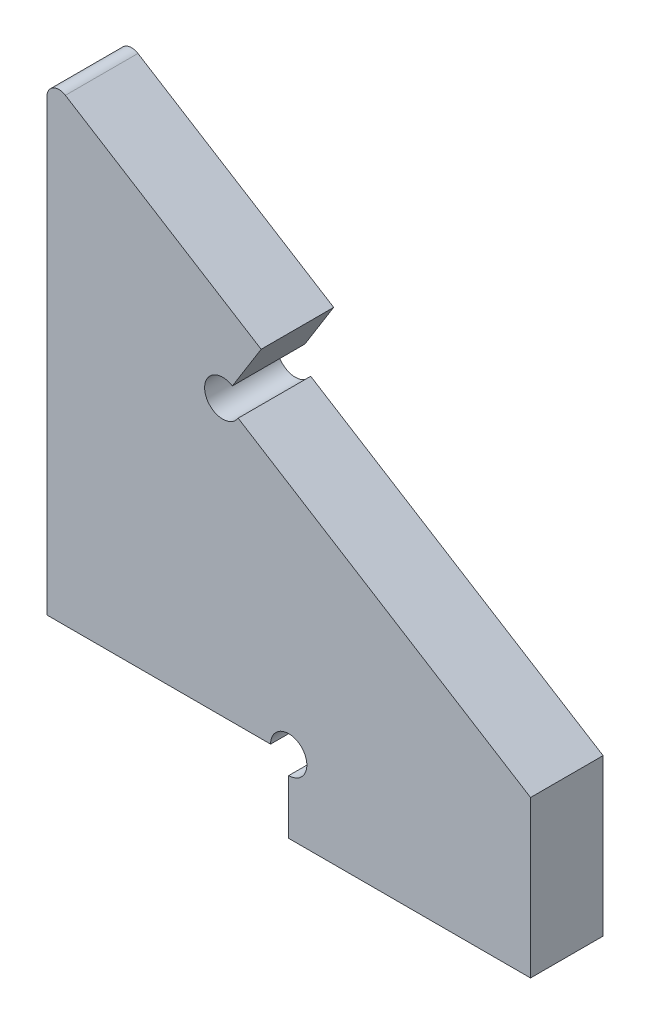
ISO-10303-21;
HEADER;
FILE_DESCRIPTION(('STEP AP214'),'2;1');
FILE_NAME('part.step','',(''),(''),'','','');
FILE_SCHEMA(('AUTOMOTIVE_DESIGN { 1 0 10303 214 1 1 1 1 }'));
ENDSEC;
DATA;
#1=APPLICATION_CONTEXT('core data for automotive mechanical design processes');
#2=APPLICATION_PROTOCOL_DEFINITION('international standard','automotive_design',2000,#1);
#3=PRODUCT_CONTEXT('',#1,'mechanical');
#4=PRODUCT('Part','Part','',(#3));
#5=PRODUCT_RELATED_PRODUCT_CATEGORY('part','',(#4));
#6=PRODUCT_DEFINITION_FORMATION('','',#4);
#7=PRODUCT_DEFINITION_CONTEXT('part definition',#1,'design');
#8=PRODUCT_DEFINITION('design','',#6,#7);
#9=PRODUCT_DEFINITION_SHAPE('','',#8);
#10=(LENGTH_UNIT() NAMED_UNIT(*) SI_UNIT(.MILLI.,.METRE.));
#11=(NAMED_UNIT(*) PLANE_ANGLE_UNIT() SI_UNIT($,.RADIAN.));
#12=(NAMED_UNIT(*) SI_UNIT($,.STERADIAN.) SOLID_ANGLE_UNIT());
#13=UNCERTAINTY_MEASURE_WITH_UNIT(LENGTH_MEASURE(1.E-05),#10,'distance_accuracy_value','');
#14=(GEOMETRIC_REPRESENTATION_CONTEXT(3) GLOBAL_UNCERTAINTY_ASSIGNED_CONTEXT((#13)) GLOBAL_UNIT_ASSIGNED_CONTEXT((#10,
#11,#12)) REPRESENTATION_CONTEXT('',''));
#15=CARTESIAN_POINT('',(0.,0.,0.));
#16=DIRECTION('',(0.,0.,1.));
#17=DIRECTION('',(1.,0.,0.));
#18=AXIS2_PLACEMENT_3D('',#15,#16,#17);
#19=CARTESIAN_POINT('',(691.,126.,3.));
#20=DIRECTION('',(-1.,0.,0.));
#21=DIRECTION('',(0.,0.,1.));
#22=AXIS2_PLACEMENT_3D('',#19,#20,#21);
#23=PLANE('',#22);
#24=DIRECTION('',(0.,0.,1.));
#25=VECTOR('',#24,1.);
#26=CARTESIAN_POINT('',(691.,124.5,-3.));
#27=LINE('',#26,#25);
#28=CARTESIAN_POINT('',(691.,124.5,-3.));
#29=VERTEX_POINT('',#28);
#30=CARTESIAN_POINT('',(691.,124.5,3.));
#31=VERTEX_POINT('',#30);
#32=EDGE_CURVE('E154',#29,#31,#27,.T.);
#33=ORIENTED_EDGE('',*,*,#32,.F.);
#34=DIRECTION('',(0.,1.,0.));
#35=VECTOR('',#34,1.);
#36=CARTESIAN_POINT('',(691.,126.,-3.));
#37=LINE('',#36,#35);
#38=CARTESIAN_POINT('',(691.,120.,-3.));
#39=VERTEX_POINT('',#38);
#40=EDGE_CURVE('E189',#39,#29,#37,.T.);
#41=ORIENTED_EDGE('',*,*,#40,.F.);
#42=DIRECTION('',(0.,0.,-1.));
#43=VECTOR('',#42,1.);
#44=CARTESIAN_POINT('',(691.,120.,3.));
#45=LINE('',#44,#43);
#46=CARTESIAN_POINT('',(691.,120.,3.));
#47=VERTEX_POINT('',#46);
#48=EDGE_CURVE('E207',#47,#39,#45,.T.);
#49=ORIENTED_EDGE('',*,*,#48,.F.);
#50=DIRECTION('',(0.,1.,0.));
#51=VECTOR('',#50,1.);
#52=CARTESIAN_POINT('',(691.,126.,3.));
#53=LINE('',#52,#51);
#54=EDGE_CURVE('E193',#47,#31,#53,.T.);
#55=ORIENTED_EDGE('',*,*,#54,.T.);
#56=EDGE_LOOP('',(#33,#41,#49,#55));
#57=FACE_BOUND('',#56,.T.);
#58=ADVANCED_FACE('F40',(#57),#23,.T.);
#59=CARTESIAN_POINT('',(691.,120.,3.));
#60=DIRECTION('',(0.,-1.,0.));
#61=DIRECTION('',(0.,0.,-1.));
#62=AXIS2_PLACEMENT_3D('',#59,#60,#61);
#63=PLANE('',#62);
#64=DIRECTION('',(-1.,0.,0.));
#65=VECTOR('',#64,1.);
#66=CARTESIAN_POINT('',(691.,120.,-3.));
#67=LINE('',#66,#65);
#68=CARTESIAN_POINT('',(711.,120.,-3.));
#69=VERTEX_POINT('',#68);
#70=EDGE_CURVE('E200',#69,#39,#67,.T.);
#71=ORIENTED_EDGE('',*,*,#70,.F.);
#72=DIRECTION('',(0.,0.,-1.));
#73=VECTOR('',#72,1.);
#74=CARTESIAN_POINT('',(711.,120.,3.));
#75=LINE('',#74,#73);
#76=CARTESIAN_POINT('',(711.,120.,3.));
#77=VERTEX_POINT('',#76);
#78=EDGE_CURVE('E197',#77,#69,#75,.T.);
#79=ORIENTED_EDGE('',*,*,#78,.F.);
#80=DIRECTION('',(-1.,0.,0.));
#81=VECTOR('',#80,1.);
#82=CARTESIAN_POINT('',(691.,120.,3.));
#83=LINE('',#82,#81);
#84=EDGE_CURVE('E188',#77,#47,#83,.T.);
#85=ORIENTED_EDGE('',*,*,#84,.T.);
#86=ORIENTED_EDGE('',*,*,#48,.T.);
#87=EDGE_LOOP('',(#71,#79,#85,#86));
#88=FACE_BOUND('',#87,.T.);
#89=ADVANCED_FACE('F283',(#88),#63,.T.);
#90=CARTESIAN_POINT('',(711.,126.,3.));
#91=DIRECTION('',(1.,0.,0.));
#92=DIRECTION('',(0.,0.,-1.));
#93=AXIS2_PLACEMENT_3D('',#90,#91,#92);
#94=PLANE('',#93);
#95=DIRECTION('',(0.,0.,1.));
#96=VECTOR('',#95,1.);
#97=CARTESIAN_POINT('',(711.,132.929169143466,-3.));
#98=LINE('',#97,#96);
#99=CARTESIAN_POINT('',(711.,132.929169143466,-3.));
#100=VERTEX_POINT('',#99);
#101=CARTESIAN_POINT('',(711.,132.929169143466,3.));
#102=VERTEX_POINT('',#101);
#103=EDGE_CURVE('E138',#100,#102,#98,.T.);
#104=ORIENTED_EDGE('',*,*,#103,.T.);
#105=DIRECTION('',(0.,-1.,0.));
#106=VECTOR('',#105,1.);
#107=CARTESIAN_POINT('',(711.,126.,3.));
#108=LINE('',#107,#106);
#109=EDGE_CURVE('E185',#102,#77,#108,.T.);
#110=ORIENTED_EDGE('',*,*,#109,.T.);
#111=ORIENTED_EDGE('',*,*,#78,.T.);
#112=DIRECTION('',(0.,-1.,0.));
#113=VECTOR('',#112,1.);
#114=CARTESIAN_POINT('',(711.,126.,-3.));
#115=LINE('',#114,#113);
#116=EDGE_CURVE('E164',#100,#69,#115,.T.);
#117=ORIENTED_EDGE('',*,*,#116,.F.);
#118=EDGE_LOOP('',(#104,#110,#111,#117));
#119=FACE_BOUND('',#118,.T.);
#120=ADVANCED_FACE('F258',(#119),#94,.T.);
#121=CARTESIAN_POINT('',(0.,0.,3.));
#122=DIRECTION('',(0.,0.,-1.));
#123=DIRECTION('',(-1.,0.,0.));
#124=AXIS2_PLACEMENT_3D('',#121,#122,#123);
#125=PLANE('',#124);
#126=DIRECTION('',(-0.848556573016444,0.529104661093236,0.));
#127=VECTOR('',#126,1.);
#128=CARTESIAN_POINT('',(258.727594190951,414.936810834059,3.));
#129=LINE('',#128,#127);
#130=CARTESIAN_POINT('',(686.816137669031,148.008651984623,3.));
#131=VERTEX_POINT('',#130);
#132=EDGE_CURVE('E131',#102,#131,#129,.T.);
#133=ORIENTED_EDGE('',*,*,#132,.T.);
#134=CARTESIAN_POINT('',(685.543302809506,148.802308976263,3.));
#135=DIRECTION('',(0.,0.,1.));
#136=DIRECTION('',(1.,0.,0.));
#137=AXIS2_PLACEMENT_3D('',#134,#135,#136);
#138=CIRCLE('',#137,1.49999999999996);
#139=CARTESIAN_POINT('',(686.336959801146,150.075143835788,3.));
#140=VERTEX_POINT('',#139);
#141=EDGE_CURVE('E123',#140,#131,#138,.T.);
#142=ORIENTED_EDGE('',*,*,#141,.F.);
#143=DIRECTION('',(0.529104661093235,0.848556573016445,0.));
#144=VECTOR('',#143,1.);
#145=CARTESIAN_POINT('',(426.815708618556,-266.134501857796,3.));
#146=LINE('',#145,#144);
#147=CARTESIAN_POINT('',(688.717930776066,153.893648414362,3.));
#148=VERTEX_POINT('',#147);
#149=EDGE_CURVE('E129',#140,#148,#146,.T.);
#150=ORIENTED_EDGE('',*,*,#149,.T.);
#151=DIRECTION('',(-0.848556573016445,0.529104661093235,0.));
#152=VECTOR('',#151,1.);
#153=CARTESIAN_POINT('',(656.818593037968,173.783999652838,3.));
#154=LINE('',#153,#152);
#155=CARTESIAN_POINT('',(672.529104661093,163.987946929558,3.));
#156=VERTEX_POINT('',#155);
#157=EDGE_CURVE('E165',#148,#156,#154,.T.);
#158=ORIENTED_EDGE('',*,*,#157,.T.);
#159=CARTESIAN_POINT('',(672.,163.139390356542,3.));
#160=DIRECTION('',(0.,0.,-1.));
#161=DIRECTION('',(-1.,0.,0.));
#162=AXIS2_PLACEMENT_3D('',#159,#160,#161);
#163=CIRCLE('',#162,1.);
#164=CARTESIAN_POINT('',(671.,163.139390356542,3.));
#165=VERTEX_POINT('',#164);
#166=EDGE_CURVE('E49',#156,#165,#163,.F.);
#167=ORIENTED_EDGE('',*,*,#166,.T.);
#168=DIRECTION('',(0.,-1.,0.));
#169=VECTOR('',#168,1.);
#170=CARTESIAN_POINT('',(671.,196.527564352098,3.));
#171=LINE('',#170,#169);
#172=CARTESIAN_POINT('',(671.,126.,3.));
#173=VERTEX_POINT('',#172);
#174=EDGE_CURVE('E177',#165,#173,#171,.T.);
#175=ORIENTED_EDGE('',*,*,#174,.T.);
#176=DIRECTION('',(1.,0.,0.));
#177=VECTOR('',#176,1.);
#178=CARTESIAN_POINT('',(671.,126.,3.));
#179=LINE('',#178,#177);
#180=CARTESIAN_POINT('',(689.5,126.,3.));
#181=VERTEX_POINT('',#180);
#182=EDGE_CURVE('E173',#173,#181,#179,.T.);
#183=ORIENTED_EDGE('',*,*,#182,.T.);
#184=CARTESIAN_POINT('',(691.,126.,3.));
#185=DIRECTION('',(0.,0.,1.));
#186=DIRECTION('',(1.,0.,0.));
#187=AXIS2_PLACEMENT_3D('',#184,#185,#186);
#188=CIRCLE('',#187,1.49999999999996);
#189=EDGE_CURVE('E143',#31,#181,#188,.T.);
#190=ORIENTED_EDGE('',*,*,#189,.F.);
#191=ORIENTED_EDGE('',*,*,#54,.F.);
#192=ORIENTED_EDGE('',*,*,#84,.F.);
#193=ORIENTED_EDGE('',*,*,#109,.F.);
#194=EDGE_LOOP('',(#133,#142,#150,#158,#167,#175,#183,#190,#191,#192,#193));
#195=FACE_BOUND('',#194,.T.);
#196=ADVANCED_FACE('F128',(#195),#125,.F.);
#197=CARTESIAN_POINT('',(0.,0.,-3.));
#198=DIRECTION('',(0.,0.,-1.));
#199=DIRECTION('',(-1.,0.,0.));
#200=AXIS2_PLACEMENT_3D('',#197,#198,#199);
#201=PLANE('',#200);
#202=CARTESIAN_POINT('',(685.543302809506,148.802308976263,-3.));
#203=DIRECTION('',(0.,0.,1.));
#204=DIRECTION('',(1.,0.,0.));
#205=AXIS2_PLACEMENT_3D('',#202,#203,#204);
#206=CIRCLE('',#205,1.49999999999996);
#207=CARTESIAN_POINT('',(686.336959801146,150.075143835788,-3.));
#208=VERTEX_POINT('',#207);
#209=CARTESIAN_POINT('',(686.816137669031,148.008651984623,-3.));
#210=VERTEX_POINT('',#209);
#211=EDGE_CURVE('E56',#208,#210,#206,.T.);
#212=ORIENTED_EDGE('',*,*,#211,.T.);
#213=DIRECTION('',(0.848556573016444,-0.529104661093236,0.));
#214=VECTOR('',#213,1.);
#215=CARTESIAN_POINT('',(685.543302809506,148.802308976263,-3.));
#216=LINE('',#215,#214);
#217=EDGE_CURVE('E243',#210,#100,#216,.T.);
#218=ORIENTED_EDGE('',*,*,#217,.T.);
#219=ORIENTED_EDGE('',*,*,#116,.T.);
#220=ORIENTED_EDGE('',*,*,#70,.T.);
#221=ORIENTED_EDGE('',*,*,#40,.T.);
#222=CARTESIAN_POINT('',(691.,126.,-3.));
#223=DIRECTION('',(0.,0.,1.));
#224=DIRECTION('',(1.,0.,0.));
#225=AXIS2_PLACEMENT_3D('',#222,#223,#224);
#226=CIRCLE('',#225,1.49999999999996);
#227=CARTESIAN_POINT('',(689.5,126.,-3.));
#228=VERTEX_POINT('',#227);
#229=EDGE_CURVE('E150',#29,#228,#226,.T.);
#230=ORIENTED_EDGE('',*,*,#229,.T.);
#231=DIRECTION('',(-1.,0.,0.));
#232=VECTOR('',#231,1.);
#233=CARTESIAN_POINT('',(671.,126.,-3.));
#234=LINE('',#233,#232);
#235=CARTESIAN_POINT('',(671.,126.,-3.));
#236=VERTEX_POINT('',#235);
#237=EDGE_CURVE('E159',#228,#236,#234,.T.);
#238=ORIENTED_EDGE('',*,*,#237,.T.);
#239=DIRECTION('',(0.,-1.,0.));
#240=VECTOR('',#239,1.);
#241=CARTESIAN_POINT('',(671.,196.527564352098,-3.));
#242=LINE('',#241,#240);
#243=CARTESIAN_POINT('',(671.,163.139390356542,-3.));
#244=VERTEX_POINT('',#243);
#245=EDGE_CURVE('E180',#244,#236,#242,.T.);
#246=ORIENTED_EDGE('',*,*,#245,.F.);
#247=CARTESIAN_POINT('',(672.,163.139390356542,-3.));
#248=DIRECTION('',(0.,0.,-1.));
#249=DIRECTION('',(-1.,0.,0.));
#250=AXIS2_PLACEMENT_3D('',#247,#248,#249);
#251=CIRCLE('',#250,1.);
#252=CARTESIAN_POINT('',(672.529104661093,163.987946929558,-3.));
#253=VERTEX_POINT('',#252);
#254=EDGE_CURVE('E221',#244,#253,#251,.T.);
#255=ORIENTED_EDGE('',*,*,#254,.T.);
#256=DIRECTION('',(0.848556573016445,-0.529104661093235,0.));
#257=VECTOR('',#256,1.);
#258=CARTESIAN_POINT('',(656.818593037968,173.783999652838,-3.));
#259=LINE('',#258,#257);
#260=CARTESIAN_POINT('',(688.717930776066,153.893648414362,-3.));
#261=VERTEX_POINT('',#260);
#262=EDGE_CURVE('E160',#253,#261,#259,.T.);
#263=ORIENTED_EDGE('',*,*,#262,.T.);
#264=DIRECTION('',(-0.529104661093235,-0.848556573016445,0.));
#265=VECTOR('',#264,1.);
#266=CARTESIAN_POINT('',(688.717930776066,153.893648414362,-3.));
#267=LINE('',#266,#265);
#268=EDGE_CURVE('E62',#261,#208,#267,.T.);
#269=ORIENTED_EDGE('',*,*,#268,.T.);
#270=EDGE_LOOP('',(#212,#218,#219,#220,#221,#230,#238,#246,#255,#263,#269));
#271=FACE_BOUND('',#270,.T.);
#272=ADVANCED_FACE('F239',(#271),#201,.T.);
#273=CARTESIAN_POINT('',(0.,126.,0.));
#274=DIRECTION('',(0.,1.,0.));
#275=DIRECTION('',(0.,0.,1.));
#276=AXIS2_PLACEMENT_3D('',#273,#274,#275);
#277=PLANE('',#276);
#278=ORIENTED_EDGE('',*,*,#237,.F.);
#279=DIRECTION('',(0.,0.,1.));
#280=VECTOR('',#279,1.);
#281=CARTESIAN_POINT('',(689.5,126.,-3.));
#282=LINE('',#281,#280);
#283=EDGE_CURVE('E210',#228,#181,#282,.T.);
#284=ORIENTED_EDGE('',*,*,#283,.T.);
#285=ORIENTED_EDGE('',*,*,#182,.F.);
#286=DIRECTION('',(0.,0.,1.));
#287=VECTOR('',#286,1.);
#288=CARTESIAN_POINT('',(671.,126.,-3.));
#289=LINE('',#288,#287);
#290=EDGE_CURVE('E169',#236,#173,#289,.T.);
#291=ORIENTED_EDGE('',*,*,#290,.F.);
#292=EDGE_LOOP('',(#278,#284,#285,#291));
#293=FACE_BOUND('',#292,.T.);
#294=ADVANCED_FACE('F272',(#293),#277,.F.);
#295=CARTESIAN_POINT('',(671.,196.527564352098,-3.));
#296=DIRECTION('',(1.,0.,0.));
#297=DIRECTION('',(0.,0.,-1.));
#298=AXIS2_PLACEMENT_3D('',#295,#296,#297);
#299=PLANE('',#298);
#300=ORIENTED_EDGE('',*,*,#174,.F.);
#301=DIRECTION('',(0.,0.,-1.));
#302=VECTOR('',#301,1.);
#303=CARTESIAN_POINT('',(671.,163.139390356542,-3.));
#304=LINE('',#303,#302);
#305=EDGE_CURVE('E217',#165,#244,#304,.T.);
#306=ORIENTED_EDGE('',*,*,#305,.T.);
#307=ORIENTED_EDGE('',*,*,#245,.T.);
#308=ORIENTED_EDGE('',*,*,#290,.T.);
#309=EDGE_LOOP('',(#300,#306,#307,#308));
#310=FACE_BOUND('',#309,.T.);
#311=ADVANCED_FACE('F233',(#310),#299,.F.);
#312=CARTESIAN_POINT('',(261.90222215751,420.028150272158,347.5));
#313=DIRECTION('',(-0.529104661093235,-0.848556573016445,0.));
#314=DIRECTION('',(0.848556573016445,-0.529104661093235,0.));
#315=AXIS2_PLACEMENT_3D('',#312,#313,#314);
#316=PLANE('',#315);
#317=ORIENTED_EDGE('',*,*,#157,.F.);
#318=DIRECTION('',(0.,0.,1.));
#319=VECTOR('',#318,1.);
#320=CARTESIAN_POINT('',(688.717930776066,153.893648414362,-3.));
#321=LINE('',#320,#319);
#322=EDGE_CURVE('E135',#261,#148,#321,.T.);
#323=ORIENTED_EDGE('',*,*,#322,.F.);
#324=ORIENTED_EDGE('',*,*,#262,.F.);
#325=DIRECTION('',(0.,0.,-1.));
#326=VECTOR('',#325,1.);
#327=CARTESIAN_POINT('',(672.529104661093,163.987946929558,347.5));
#328=LINE('',#327,#326);
#329=EDGE_CURVE('E224',#253,#156,#328,.F.);
#330=ORIENTED_EDGE('',*,*,#329,.T.);
#331=EDGE_LOOP('',(#317,#323,#324,#330));
#332=FACE_BOUND('',#331,.T.);
#333=ADVANCED_FACE('F241',(#332),#316,.F.);
#334=CARTESIAN_POINT('',(691.,126.,-3.));
#335=DIRECTION('',(0.,0.,1.));
#336=DIRECTION('',(1.,0.,0.));
#337=AXIS2_PLACEMENT_3D('',#334,#335,#336);
#338=CYLINDRICAL_SURFACE('',#337,1.49999999999996);
#339=ORIENTED_EDGE('',*,*,#32,.T.);
#340=ORIENTED_EDGE('',*,*,#189,.T.);
#341=ORIENTED_EDGE('',*,*,#283,.F.);
#342=ORIENTED_EDGE('',*,*,#229,.F.);
#343=EDGE_LOOP('',(#339,#340,#341,#342));
#344=FACE_BOUND('',#343,.T.);
#345=ADVANCED_FACE('F268',(#344),#338,.F.);
#346=CARTESIAN_POINT('',(672.,163.139390356542,-3.));
#347=DIRECTION('',(0.,0.,-1.));
#348=DIRECTION('',(0.,1.,0.));
#349=AXIS2_PLACEMENT_3D('',#346,#347,#348);
#350=CYLINDRICAL_SURFACE('',#349,1.);
#351=ORIENTED_EDGE('',*,*,#166,.F.);
#352=ORIENTED_EDGE('',*,*,#329,.F.);
#353=ORIENTED_EDGE('',*,*,#254,.F.);
#354=ORIENTED_EDGE('',*,*,#305,.F.);
#355=EDGE_LOOP('',(#351,#352,#353,#354));
#356=FACE_BOUND('',#355,.T.);
#357=ADVANCED_FACE('F42',(#356),#350,.T.);
#358=CARTESIAN_POINT('',(685.543302809506,148.802308976263,-3.));
#359=DIRECTION('',(-0.529104661093236,-0.848556573016444,0.));
#360=DIRECTION('',(0.848556573016444,-0.529104661093236,0.));
#361=AXIS2_PLACEMENT_3D('',#358,#359,#360);
#362=PLANE('',#361);
#363=ORIENTED_EDGE('',*,*,#217,.F.);
#364=DIRECTION('',(0.,0.,1.));
#365=VECTOR('',#364,1.);
#366=CARTESIAN_POINT('',(686.816137669031,148.008651984623,-3.));
#367=LINE('',#366,#365);
#368=EDGE_CURVE('E250',#210,#131,#367,.T.);
#369=ORIENTED_EDGE('',*,*,#368,.T.);
#370=ORIENTED_EDGE('',*,*,#132,.F.);
#371=ORIENTED_EDGE('',*,*,#103,.F.);
#372=EDGE_LOOP('',(#363,#369,#370,#371));
#373=FACE_BOUND('',#372,.T.);
#374=ADVANCED_FACE('F255',(#373),#362,.F.);
#375=CARTESIAN_POINT('',(688.717930776066,153.893648414362,-3.));
#376=DIRECTION('',(-0.848556573016445,0.529104661093235,0.));
#377=DIRECTION('',(-0.529104661093235,-0.848556573016445,0.));
#378=AXIS2_PLACEMENT_3D('',#375,#376,#377);
#379=PLANE('',#378);
#380=ORIENTED_EDGE('',*,*,#149,.F.);
#381=DIRECTION('',(0.,0.,1.));
#382=VECTOR('',#381,1.);
#383=CARTESIAN_POINT('',(686.336959801146,150.075143835788,-3.));
#384=LINE('',#383,#382);
#385=EDGE_CURVE('E11',#140,#208,#384,.F.);
#386=ORIENTED_EDGE('',*,*,#385,.T.);
#387=ORIENTED_EDGE('',*,*,#268,.F.);
#388=ORIENTED_EDGE('',*,*,#322,.T.);
#389=EDGE_LOOP('',(#380,#386,#387,#388));
#390=FACE_BOUND('',#389,.T.);
#391=ADVANCED_FACE('F134',(#390),#379,.F.);
#392=CARTESIAN_POINT('',(685.543302809506,148.802308976263,-3.));
#393=DIRECTION('',(0.,0.,1.));
#394=DIRECTION('',(1.,0.,0.));
#395=AXIS2_PLACEMENT_3D('',#392,#393,#394);
#396=CYLINDRICAL_SURFACE('',#395,1.49999999999996);
#397=ORIENTED_EDGE('',*,*,#211,.F.);
#398=ORIENTED_EDGE('',*,*,#385,.F.);
#399=ORIENTED_EDGE('',*,*,#141,.T.);
#400=ORIENTED_EDGE('',*,*,#368,.F.);
#401=EDGE_LOOP('',(#397,#398,#399,#400));
#402=FACE_BOUND('',#401,.T.);
#403=ADVANCED_FACE('F122',(#402),#396,.F.);
#404=CLOSED_SHELL('',(#58,#89,#120,#196,#272,#294,#311,#333,#345,#357,#374,#391,#403));
#405=MANIFOLD_SOLID_BREP('B2',#404);
#406=ADVANCED_BREP_SHAPE_REPRESENTATION('',(#18,#405),#14);
#407=SHAPE_DEFINITION_REPRESENTATION(#9,#406);
ENDSEC;
END-ISO-10303-21;
